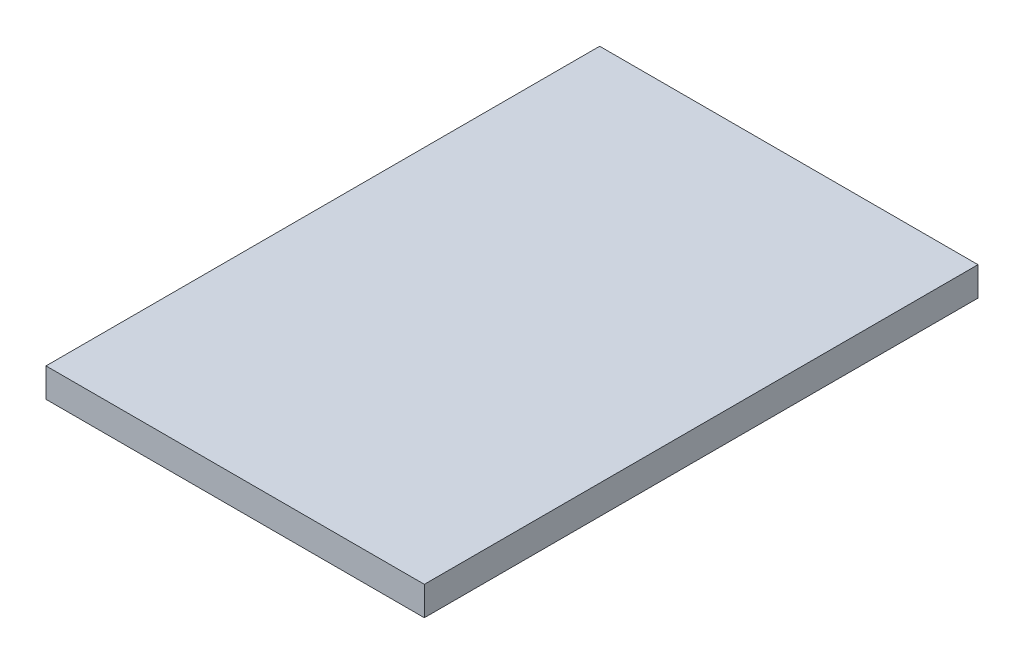
ISO-10303-21;
HEADER;
FILE_DESCRIPTION(('STEP AP214'),'2;1');
FILE_NAME('part.step','',(''),(''),'','','');
FILE_SCHEMA(('AUTOMOTIVE_DESIGN { 1 0 10303 214 1 1 1 1 }'));
ENDSEC;
DATA;
#1=APPLICATION_CONTEXT('core data for automotive mechanical design processes');
#2=APPLICATION_PROTOCOL_DEFINITION('international standard','automotive_design',2000,#1);
#3=PRODUCT_CONTEXT('',#1,'mechanical');
#4=PRODUCT('Part','Part','',(#3));
#5=PRODUCT_RELATED_PRODUCT_CATEGORY('part','',(#4));
#6=PRODUCT_DEFINITION_FORMATION('','',#4);
#7=PRODUCT_DEFINITION_CONTEXT('part definition',#1,'design');
#8=PRODUCT_DEFINITION('design','',#6,#7);
#9=PRODUCT_DEFINITION_SHAPE('','',#8);
#10=(LENGTH_UNIT() NAMED_UNIT(*) SI_UNIT(.MILLI.,.METRE.));
#11=(NAMED_UNIT(*) PLANE_ANGLE_UNIT() SI_UNIT($,.RADIAN.));
#12=(NAMED_UNIT(*) SI_UNIT($,.STERADIAN.) SOLID_ANGLE_UNIT());
#13=UNCERTAINTY_MEASURE_WITH_UNIT(LENGTH_MEASURE(1.E-05),#10,'distance_accuracy_value','');
#14=(GEOMETRIC_REPRESENTATION_CONTEXT(3) GLOBAL_UNCERTAINTY_ASSIGNED_CONTEXT((#13)) GLOBAL_UNIT_ASSIGNED_CONTEXT((#10,
#11,#12)) REPRESENTATION_CONTEXT('',''));
#15=CARTESIAN_POINT('',(0.,0.,0.));
#16=DIRECTION('',(0.,0.,1.));
#17=DIRECTION('',(1.,0.,0.));
#18=AXIS2_PLACEMENT_3D('',#15,#16,#17);
#19=CARTESIAN_POINT('',(0.,1.57,0.));
#20=DIRECTION('',(1.,0.,0.));
#21=DIRECTION('',(0.,0.,-1.));
#22=AXIS2_PLACEMENT_3D('',#19,#20,#21);
#23=PLANE('',#22);
#24=DIRECTION('',(0.,0.,1.));
#25=VECTOR('',#24,1.);
#26=CARTESIAN_POINT('',(0.,0.,0.));
#27=LINE('',#26,#25);
#28=CARTESIAN_POINT('',(0.,0.,-30.));
#29=VERTEX_POINT('',#28);
#30=CARTESIAN_POINT('',(0.,0.,0.));
#31=VERTEX_POINT('',#30);
#32=EDGE_CURVE('E108',#29,#31,#27,.T.);
#33=ORIENTED_EDGE('',*,*,#32,.T.);
#34=DIRECTION('',(0.,-1.,0.));
#35=VECTOR('',#34,1.);
#36=CARTESIAN_POINT('',(0.,1.57,0.));
#37=LINE('',#36,#35);
#38=CARTESIAN_POINT('',(0.,1.57,0.));
#39=VERTEX_POINT('',#38);
#40=EDGE_CURVE('E11',#39,#31,#37,.T.);
#41=ORIENTED_EDGE('',*,*,#40,.F.);
#42=DIRECTION('',(0.,0.,1.));
#43=VECTOR('',#42,1.);
#44=CARTESIAN_POINT('',(0.,1.57,0.));
#45=LINE('',#44,#43);
#46=CARTESIAN_POINT('',(0.,1.57,-30.));
#47=VERTEX_POINT('',#46);
#48=EDGE_CURVE('E96',#47,#39,#45,.T.);
#49=ORIENTED_EDGE('',*,*,#48,.F.);
#50=DIRECTION('',(0.,-1.,0.));
#51=VECTOR('',#50,1.);
#52=CARTESIAN_POINT('',(0.,1.57,-30.));
#53=LINE('',#52,#51);
#54=EDGE_CURVE('E104',#47,#29,#53,.T.);
#55=ORIENTED_EDGE('',*,*,#54,.T.);
#56=EDGE_LOOP('',(#33,#41,#49,#55));
#57=FACE_BOUND('',#56,.T.);
#58=ADVANCED_FACE('F45',(#57),#23,.F.);
#59=CARTESIAN_POINT('',(0.,1.57,0.));
#60=DIRECTION('',(0.,0.,-1.));
#61=DIRECTION('',(-1.,0.,0.));
#62=AXIS2_PLACEMENT_3D('',#59,#60,#61);
#63=PLANE('',#62);
#64=DIRECTION('',(1.,0.,0.));
#65=VECTOR('',#64,1.);
#66=CARTESIAN_POINT('',(0.,0.,0.));
#67=LINE('',#66,#65);
#68=CARTESIAN_POINT('',(20.5,0.,0.));
#69=VERTEX_POINT('',#68);
#70=EDGE_CURVE('E100',#31,#69,#67,.T.);
#71=ORIENTED_EDGE('',*,*,#70,.T.);
#72=DIRECTION('',(0.,-1.,0.));
#73=VECTOR('',#72,1.);
#74=CARTESIAN_POINT('',(20.5,1.57,0.));
#75=LINE('',#74,#73);
#76=CARTESIAN_POINT('',(20.5,1.57,0.));
#77=VERTEX_POINT('',#76);
#78=EDGE_CURVE('E53',#77,#69,#75,.T.);
#79=ORIENTED_EDGE('',*,*,#78,.F.);
#80=DIRECTION('',(1.,0.,0.));
#81=VECTOR('',#80,1.);
#82=CARTESIAN_POINT('',(0.,1.57,0.));
#83=LINE('',#82,#81);
#84=EDGE_CURVE('E91',#39,#77,#83,.T.);
#85=ORIENTED_EDGE('',*,*,#84,.F.);
#86=ORIENTED_EDGE('',*,*,#40,.T.);
#87=EDGE_LOOP('',(#71,#79,#85,#86));
#88=FACE_BOUND('',#87,.T.);
#89=ADVANCED_FACE('F99',(#88),#63,.F.);
#90=CARTESIAN_POINT('',(20.5,1.57,0.));
#91=DIRECTION('',(-1.,0.,0.));
#92=DIRECTION('',(0.,0.,1.));
#93=AXIS2_PLACEMENT_3D('',#90,#91,#92);
#94=PLANE('',#93);
#95=DIRECTION('',(0.,0.,-1.));
#96=VECTOR('',#95,1.);
#97=CARTESIAN_POINT('',(20.5,0.,0.));
#98=LINE('',#97,#96);
#99=CARTESIAN_POINT('',(20.5,0.,-30.));
#100=VERTEX_POINT('',#99);
#101=EDGE_CURVE('E78',#69,#100,#98,.T.);
#102=ORIENTED_EDGE('',*,*,#101,.T.);
#103=DIRECTION('',(0.,-1.,0.));
#104=VECTOR('',#103,1.);
#105=CARTESIAN_POINT('',(20.5,1.57,-30.));
#106=LINE('',#105,#104);
#107=CARTESIAN_POINT('',(20.5,1.57,-30.));
#108=VERTEX_POINT('',#107);
#109=EDGE_CURVE('E101',#108,#100,#106,.T.);
#110=ORIENTED_EDGE('',*,*,#109,.F.);
#111=DIRECTION('',(0.,0.,-1.));
#112=VECTOR('',#111,1.);
#113=CARTESIAN_POINT('',(20.5,1.57,0.));
#114=LINE('',#113,#112);
#115=EDGE_CURVE('E94',#77,#108,#114,.T.);
#116=ORIENTED_EDGE('',*,*,#115,.F.);
#117=ORIENTED_EDGE('',*,*,#78,.T.);
#118=EDGE_LOOP('',(#102,#110,#116,#117));
#119=FACE_BOUND('',#118,.T.);
#120=ADVANCED_FACE('F102',(#119),#94,.F.);
#121=CARTESIAN_POINT('',(0.,1.57,-30.));
#122=DIRECTION('',(0.,0.,1.));
#123=DIRECTION('',(1.,0.,0.));
#124=AXIS2_PLACEMENT_3D('',#121,#122,#123);
#125=PLANE('',#124);
#126=DIRECTION('',(-1.,0.,0.));
#127=VECTOR('',#126,1.);
#128=CARTESIAN_POINT('',(0.,0.,-30.));
#129=LINE('',#128,#127);
#130=EDGE_CURVE('E84',#100,#29,#129,.T.);
#131=ORIENTED_EDGE('',*,*,#130,.T.);
#132=ORIENTED_EDGE('',*,*,#54,.F.);
#133=DIRECTION('',(-1.,0.,0.));
#134=VECTOR('',#133,1.);
#135=CARTESIAN_POINT('',(0.,1.57,-30.));
#136=LINE('',#135,#134);
#137=EDGE_CURVE('E61',#108,#47,#136,.T.);
#138=ORIENTED_EDGE('',*,*,#137,.F.);
#139=ORIENTED_EDGE('',*,*,#109,.T.);
#140=EDGE_LOOP('',(#131,#132,#138,#139));
#141=FACE_BOUND('',#140,.T.);
#142=ADVANCED_FACE('F115',(#141),#125,.F.);
#143=CARTESIAN_POINT('',(0.,1.57,0.));
#144=DIRECTION('',(0.,-1.,0.));
#145=DIRECTION('',(0.,0.,-1.));
#146=AXIS2_PLACEMENT_3D('',#143,#144,#145);
#147=PLANE('',#146);
#148=ORIENTED_EDGE('',*,*,#48,.T.);
#149=ORIENTED_EDGE('',*,*,#84,.T.);
#150=ORIENTED_EDGE('',*,*,#115,.T.);
#151=ORIENTED_EDGE('',*,*,#137,.T.);
#152=EDGE_LOOP('',(#148,#149,#150,#151));
#153=FACE_BOUND('',#152,.T.);
#154=ADVANCED_FACE('F92',(#153),#147,.F.);
#155=CARTESIAN_POINT('',(0.,0.,0.));
#156=DIRECTION('',(0.,-1.,0.));
#157=DIRECTION('',(0.,0.,-1.));
#158=AXIS2_PLACEMENT_3D('',#155,#156,#157);
#159=PLANE('',#158);
#160=ORIENTED_EDGE('',*,*,#32,.F.);
#161=ORIENTED_EDGE('',*,*,#130,.F.);
#162=ORIENTED_EDGE('',*,*,#101,.F.);
#163=ORIENTED_EDGE('',*,*,#70,.F.);
#164=EDGE_LOOP('',(#160,#161,#162,#163));
#165=FACE_BOUND('',#164,.T.);
#166=ADVANCED_FACE('F118',(#165),#159,.T.);
#167=CLOSED_SHELL('',(#58,#89,#120,#142,#154,#166));
#168=MANIFOLD_SOLID_BREP('B2',#167);
#169=ADVANCED_BREP_SHAPE_REPRESENTATION('',(#18,#168),#14);
#170=SHAPE_DEFINITION_REPRESENTATION(#9,#169);
ENDSEC;
END-ISO-10303-21;
